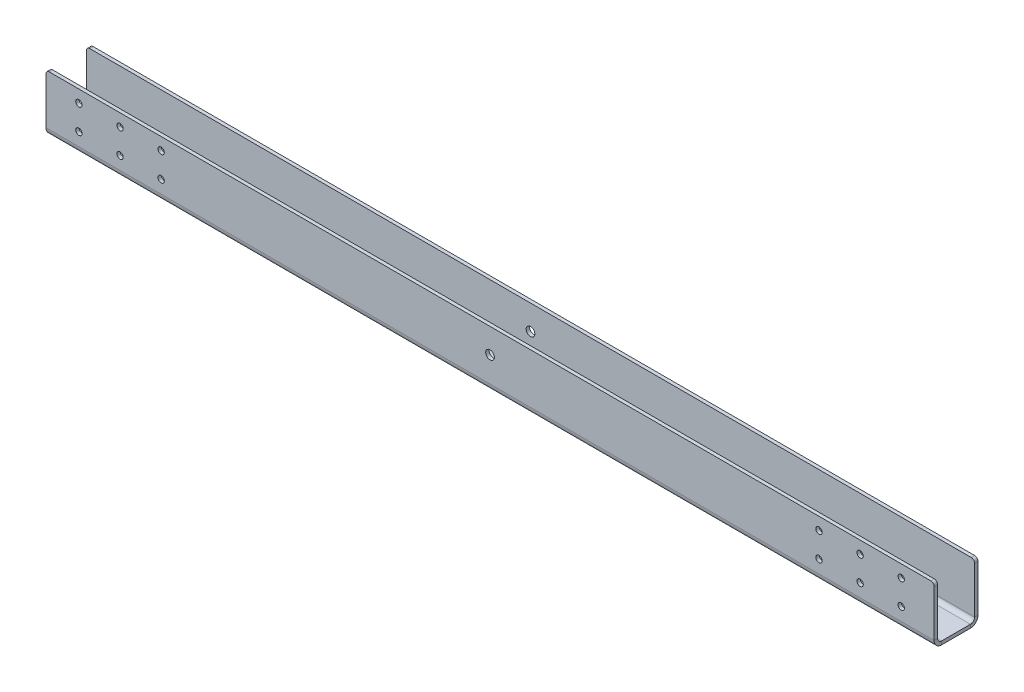
ISO-10303-21;
HEADER;
FILE_DESCRIPTION(('STEP AP214'),'2;1');
FILE_NAME('part.step','',(''),(''),'','','');
FILE_SCHEMA(('AUTOMOTIVE_DESIGN { 1 0 10303 214 1 1 1 1 }'));
ENDSEC;
DATA;
#1=APPLICATION_CONTEXT('core data for automotive mechanical design processes');
#2=APPLICATION_PROTOCOL_DEFINITION('international standard','automotive_design',2000,#1);
#3=PRODUCT_CONTEXT('',#1,'mechanical');
#4=PRODUCT('Part','Part','',(#3));
#5=PRODUCT_RELATED_PRODUCT_CATEGORY('part','',(#4));
#6=PRODUCT_DEFINITION_FORMATION('','',#4);
#7=PRODUCT_DEFINITION_CONTEXT('part definition',#1,'design');
#8=PRODUCT_DEFINITION('design','',#6,#7);
#9=PRODUCT_DEFINITION_SHAPE('','',#8);
#10=(LENGTH_UNIT() NAMED_UNIT(*) SI_UNIT(.MILLI.,.METRE.));
#11=(NAMED_UNIT(*) PLANE_ANGLE_UNIT() SI_UNIT($,.RADIAN.));
#12=(NAMED_UNIT(*) SI_UNIT($,.STERADIAN.) SOLID_ANGLE_UNIT());
#13=UNCERTAINTY_MEASURE_WITH_UNIT(LENGTH_MEASURE(1.E-05),#10,'distance_accuracy_value','');
#14=(GEOMETRIC_REPRESENTATION_CONTEXT(3) GLOBAL_UNCERTAINTY_ASSIGNED_CONTEXT((#13)) GLOBAL_UNIT_ASSIGNED_CONTEXT((#10,
#11,#12)) REPRESENTATION_CONTEXT('',''));
#15=CARTESIAN_POINT('',(0.,0.,0.));
#16=DIRECTION('',(0.,0.,1.));
#17=DIRECTION('',(1.,0.,0.));
#18=AXIS2_PLACEMENT_3D('',#15,#16,#17);
#19=CARTESIAN_POINT('',(0.,0.,5.83183999999999));
#20=DIRECTION('',(0.,0.,-1.));
#21=DIRECTION('',(-1.,0.,0.));
#22=AXIS2_PLACEMENT_3D('',#19,#20,#21);
#23=PLANE('',#22);
#24=CARTESIAN_POINT('',(596.899999999998,13.2181599999988,5.83183999999999));
#25=DIRECTION('',(0.,0.,1.));
#26=DIRECTION('',(1.,0.,0.));
#27=AXIS2_PLACEMENT_3D('',#24,#25,#26);
#28=CIRCLE('',#27,2.45744999999997);
#29=CARTESIAN_POINT('',(599.357449999998,13.2181599999988,5.83183999999999));
#30=VERTEX_POINT('',#29);
#31=EDGE_CURVE('E901',#30,#30,#28,.T.);
#32=ORIENTED_EDGE('',*,*,#31,.F.);
#33=EDGE_LOOP('',(#32));
#34=FACE_BOUND('',#33,.T.);
#35=CARTESIAN_POINT('',(596.899999999998,32.2681599999988,5.83183999999999));
#36=DIRECTION('',(0.,0.,1.));
#37=DIRECTION('',(1.,0.,0.));
#38=AXIS2_PLACEMENT_3D('',#35,#36,#37);
#39=CIRCLE('',#38,2.45744999999997);
#40=CARTESIAN_POINT('',(599.357449999998,32.2681599999988,5.83183999999999));
#41=VERTEX_POINT('',#40);
#42=EDGE_CURVE('E895',#41,#41,#39,.T.);
#43=ORIENTED_EDGE('',*,*,#42,.F.);
#44=EDGE_LOOP('',(#43));
#45=FACE_BOUND('',#44,.T.);
#46=CARTESIAN_POINT('',(660.399999999998,32.2681599999992,5.83183999999999));
#47=DIRECTION('',(0.,0.,1.));
#48=DIRECTION('',(1.,0.,0.));
#49=AXIS2_PLACEMENT_3D('',#46,#47,#48);
#50=CIRCLE('',#49,2.45744999999997);
#51=CARTESIAN_POINT('',(662.857449999998,32.2681599999992,5.83183999999999));
#52=VERTEX_POINT('',#51);
#53=EDGE_CURVE('E871',#52,#52,#50,.T.);
#54=ORIENTED_EDGE('',*,*,#53,.F.);
#55=EDGE_LOOP('',(#54));
#56=FACE_BOUND('',#55,.T.);
#57=CARTESIAN_POINT('',(88.8999999999975,32.2681599999952,5.83183999999999));
#58=DIRECTION('',(0.,0.,1.));
#59=DIRECTION('',(1.,0.,0.));
#60=AXIS2_PLACEMENT_3D('',#57,#58,#59);
#61=CIRCLE('',#60,2.45744999999999);
#62=CARTESIAN_POINT('',(91.3574499999975,32.2681599999952,5.83183999999999));
#63=VERTEX_POINT('',#62);
#64=EDGE_CURVE('E859',#63,#63,#61,.T.);
#65=ORIENTED_EDGE('',*,*,#64,.F.);
#66=EDGE_LOOP('',(#65));
#67=FACE_BOUND('',#66,.T.);
#68=CARTESIAN_POINT('',(57.1499999999976,13.218159999995,5.83183999999999));
#69=DIRECTION('',(0.,0.,1.));
#70=DIRECTION('',(1.,0.,0.));
#71=AXIS2_PLACEMENT_3D('',#68,#69,#70);
#72=CIRCLE('',#71,2.45744999999999);
#73=CARTESIAN_POINT('',(59.6074499999976,13.218159999995,5.83183999999999));
#74=VERTEX_POINT('',#73);
#75=EDGE_CURVE('E853',#74,#74,#72,.T.);
#76=ORIENTED_EDGE('',*,*,#75,.F.);
#77=EDGE_LOOP('',(#76));
#78=FACE_BOUND('',#77,.T.);
#79=CARTESIAN_POINT('',(25.3999999999975,32.2681599999948,5.83183999999999));
#80=DIRECTION('',(0.,0.,1.));
#81=DIRECTION('',(1.,0.,0.));
#82=AXIS2_PLACEMENT_3D('',#79,#80,#81);
#83=CIRCLE('',#82,2.45744999999999);
#84=CARTESIAN_POINT('',(27.8574499999975,32.2681599999948,5.83183999999999));
#85=VERTEX_POINT('',#84);
#86=EDGE_CURVE('E825',#85,#85,#83,.T.);
#87=ORIENTED_EDGE('',*,*,#86,.F.);
#88=EDGE_LOOP('',(#87));
#89=FACE_BOUND('',#88,.T.);
#90=CARTESIAN_POINT('',(342.9,22.7431600000001,5.83184000000011));
#91=DIRECTION('',(0.,0.,-1.));
#92=DIRECTION('',(0.,1.,0.));
#93=AXIS2_PLACEMENT_3D('',#90,#91,#92);
#94=CIRCLE('',#93,3.373501);
#95=CARTESIAN_POINT('',(342.9,26.1166610000001,5.8318400000001));
#96=VERTEX_POINT('',#95);
#97=EDGE_CURVE('E819',#96,#96,#94,.T.);
#98=ORIENTED_EDGE('',*,*,#97,.T.);
#99=EDGE_LOOP('',(#98));
#100=FACE_BOUND('',#99,.T.);
#101=DIRECTION('',(0.,1.,0.));
#102=VECTOR('',#101,1.);
#103=CARTESIAN_POINT('',(685.8,0.,5.83183999999999));
#104=LINE('',#103,#102);
#105=CARTESIAN_POINT('',(685.8,3.17499999999999,5.83183999999999));
#106=VERTEX_POINT('',#105);
#107=CARTESIAN_POINT('',(685.8,39.25316,5.83183999999999));
#108=VERTEX_POINT('',#107);
#109=EDGE_CURVE('E253',#106,#108,#104,.T.);
#110=ORIENTED_EDGE('',*,*,#109,.T.);
#111=CARTESIAN_POINT('',(683.26,39.25316,5.83183999999999));
#112=DIRECTION('',(0.,0.,-1.));
#113=DIRECTION('',(-1.,0.,0.));
#114=AXIS2_PLACEMENT_3D('',#111,#112,#113);
#115=CIRCLE('',#114,2.54);
#116=CARTESIAN_POINT('',(683.26,41.79316,5.83183999999999));
#117=VERTEX_POINT('',#116);
#118=EDGE_CURVE('E328',#108,#117,#115,.F.);
#119=ORIENTED_EDGE('',*,*,#118,.T.);
#120=DIRECTION('',(-1.,0.,0.));
#121=VECTOR('',#120,1.);
#122=CARTESIAN_POINT('',(0.,41.79316,5.83183999999999));
#123=LINE('',#122,#121);
#124=CARTESIAN_POINT('',(2.54,41.79316,5.83183999999999));
#125=VERTEX_POINT('',#124);
#126=EDGE_CURVE('E250',#117,#125,#123,.T.);
#127=ORIENTED_EDGE('',*,*,#126,.T.);
#128=CARTESIAN_POINT('',(2.54,39.25316,5.83183999999999));
#129=DIRECTION('',(0.,0.,-1.));
#130=DIRECTION('',(-1.,0.,0.));
#131=AXIS2_PLACEMENT_3D('',#128,#129,#130);
#132=CIRCLE('',#131,2.54);
#133=CARTESIAN_POINT('',(0.,39.25316,5.83183999999999));
#134=VERTEX_POINT('',#133);
#135=EDGE_CURVE('E326',#125,#134,#132,.F.);
#136=ORIENTED_EDGE('',*,*,#135,.T.);
#137=DIRECTION('',(0.,-1.,0.));
#138=VECTOR('',#137,1.);
#139=CARTESIAN_POINT('',(0.,0.,5.83183999999999));
#140=LINE('',#139,#138);
#141=CARTESIAN_POINT('',(0.,3.17499999999999,5.83183999999999));
#142=VERTEX_POINT('',#141);
#143=EDGE_CURVE('E247',#134,#142,#140,.T.);
#144=ORIENTED_EDGE('',*,*,#143,.T.);
#145=DIRECTION('',(1.,0.,0.));
#146=VECTOR('',#145,1.);
#147=CARTESIAN_POINT('',(0.,3.17499999999999,5.83183999999999));
#148=LINE('',#147,#146);
#149=EDGE_CURVE('E264',#106,#142,#148,.F.);
#150=ORIENTED_EDGE('',*,*,#149,.F.);
#151=EDGE_LOOP('',(#110,#119,#127,#136,#144,#150));
#152=FACE_BOUND('',#151,.T.);
#153=CARTESIAN_POINT('',(25.3999999999976,13.2181599999948,5.83183999999999));
#154=DIRECTION('',(0.,0.,1.));
#155=DIRECTION('',(1.,0.,0.));
#156=AXIS2_PLACEMENT_3D('',#153,#154,#155);
#157=CIRCLE('',#156,2.45744999999999);
#158=CARTESIAN_POINT('',(27.8574499999976,13.2181599999948,5.83183999999999));
#159=VERTEX_POINT('',#158);
#160=EDGE_CURVE('E841',#159,#159,#157,.T.);
#161=ORIENTED_EDGE('',*,*,#160,.F.);
#162=EDGE_LOOP('',(#161));
#163=FACE_BOUND('',#162,.T.);
#164=CARTESIAN_POINT('',(57.1499999999975,32.268159999995,5.83183999999999));
#165=DIRECTION('',(0.,0.,1.));
#166=DIRECTION('',(1.,0.,0.));
#167=AXIS2_PLACEMENT_3D('',#164,#165,#166);
#168=CIRCLE('',#167,2.45744999999999);
#169=CARTESIAN_POINT('',(59.6074499999975,32.268159999995,5.83183999999999));
#170=VERTEX_POINT('',#169);
#171=EDGE_CURVE('E847',#170,#170,#168,.T.);
#172=ORIENTED_EDGE('',*,*,#171,.F.);
#173=EDGE_LOOP('',(#172));
#174=FACE_BOUND('',#173,.T.);
#175=CARTESIAN_POINT('',(88.8999999999976,13.2181599999952,5.83183999999999));
#176=DIRECTION('',(0.,0.,1.));
#177=DIRECTION('',(1.,0.,0.));
#178=AXIS2_PLACEMENT_3D('',#175,#176,#177);
#179=CIRCLE('',#178,2.45744999999999);
#180=CARTESIAN_POINT('',(91.3574499999976,13.2181599999952,5.83183999999999));
#181=VERTEX_POINT('',#180);
#182=EDGE_CURVE('E865',#181,#181,#179,.T.);
#183=ORIENTED_EDGE('',*,*,#182,.F.);
#184=EDGE_LOOP('',(#183));
#185=FACE_BOUND('',#184,.T.);
#186=CARTESIAN_POINT('',(660.399999999998,13.2181599999992,5.83183999999999));
#187=DIRECTION('',(0.,0.,1.));
#188=DIRECTION('',(1.,0.,0.));
#189=AXIS2_PLACEMENT_3D('',#186,#187,#188);
#190=CIRCLE('',#189,2.45744999999997);
#191=CARTESIAN_POINT('',(662.857449999998,13.2181599999992,5.83183999999999));
#192=VERTEX_POINT('',#191);
#193=EDGE_CURVE('E877',#192,#192,#190,.T.);
#194=ORIENTED_EDGE('',*,*,#193,.F.);
#195=EDGE_LOOP('',(#194));
#196=FACE_BOUND('',#195,.T.);
#197=CARTESIAN_POINT('',(628.649999999998,13.218159999999,5.83183999999999));
#198=DIRECTION('',(0.,0.,1.));
#199=DIRECTION('',(1.,0.,0.));
#200=AXIS2_PLACEMENT_3D('',#197,#198,#199);
#201=CIRCLE('',#200,2.45744999999997);
#202=CARTESIAN_POINT('',(631.107449999998,13.218159999999,5.83183999999999));
#203=VERTEX_POINT('',#202);
#204=EDGE_CURVE('E883',#203,#203,#201,.T.);
#205=ORIENTED_EDGE('',*,*,#204,.F.);
#206=EDGE_LOOP('',(#205));
#207=FACE_BOUND('',#206,.T.);
#208=CARTESIAN_POINT('',(628.649999999998,32.268159999999,5.83183999999999));
#209=DIRECTION('',(0.,0.,1.));
#210=DIRECTION('',(1.,0.,0.));
#211=AXIS2_PLACEMENT_3D('',#208,#209,#210);
#212=CIRCLE('',#211,2.45744999999997);
#213=CARTESIAN_POINT('',(631.107449999998,32.268159999999,5.83183999999999));
#214=VERTEX_POINT('',#213);
#215=EDGE_CURVE('E889',#214,#214,#212,.T.);
#216=ORIENTED_EDGE('',*,*,#215,.F.);
#217=EDGE_LOOP('',(#216));
#218=FACE_BOUND('',#217,.T.);
#219=ADVANCED_FACE('F78',(#34,#45,#56,#67,#78,#89,#100,#152,#163,#174,#185,#196,#207,#218),#23,.F.);
#220=CARTESIAN_POINT('',(0.,-2.65684,0.));
#221=DIRECTION('',(-1.,0.,0.));
#222=DIRECTION('',(0.,0.,1.));
#223=AXIS2_PLACEMENT_3D('',#220,#221,#222);
#224=PLANE('',#223);
#225=DIRECTION('',(0.,0.,1.));
#226=VECTOR('',#225,1.);
#227=CARTESIAN_POINT('',(0.,0.,0.));
#228=LINE('',#227,#226);
#229=CARTESIAN_POINT('',(0.,0.,-22.225));
#230=VERTEX_POINT('',#229);
#231=CARTESIAN_POINT('',(0.,0.,0.));
#232=VERTEX_POINT('',#231);
#233=EDGE_CURVE('E277',#230,#232,#228,.T.);
#234=ORIENTED_EDGE('',*,*,#233,.F.);
#235=DIRECTION('',(0.,1.,0.));
#236=VECTOR('',#235,1.);
#237=CARTESIAN_POINT('',(0.,-2.65684,-22.225));
#238=LINE('',#237,#236);
#239=CARTESIAN_POINT('',(0.,-2.65684000000002,-22.225));
#240=VERTEX_POINT('',#239);
#241=EDGE_CURVE('E307',#240,#230,#238,.T.);
#242=ORIENTED_EDGE('',*,*,#241,.F.);
#243=DIRECTION('',(0.,0.,1.));
#244=VECTOR('',#243,1.);
#245=CARTESIAN_POINT('',(0.,-2.65684,0.));
#246=LINE('',#245,#244);
#247=CARTESIAN_POINT('',(0.,-2.65684,0.));
#248=VERTEX_POINT('',#247);
#249=EDGE_CURVE('E286',#240,#248,#246,.T.);
#250=ORIENTED_EDGE('',*,*,#249,.T.);
#251=DIRECTION('',(0.,1.,0.));
#252=VECTOR('',#251,1.);
#253=CARTESIAN_POINT('',(0.,-2.65684,0.));
#254=LINE('',#253,#252);
#255=EDGE_CURVE('E296',#248,#232,#254,.T.);
#256=ORIENTED_EDGE('',*,*,#255,.T.);
#257=EDGE_LOOP('',(#234,#242,#250,#256));
#258=FACE_BOUND('',#257,.T.);
#259=ADVANCED_FACE('F418',(#258),#224,.T.);
#260=CARTESIAN_POINT('',(685.8,-2.65684,0.));
#261=DIRECTION('',(1.,0.,0.));
#262=DIRECTION('',(0.,0.,-1.));
#263=AXIS2_PLACEMENT_3D('',#260,#261,#262);
#264=PLANE('',#263);
#265=DIRECTION('',(0.,0.,-1.));
#266=VECTOR('',#265,1.);
#267=CARTESIAN_POINT('',(685.8,0.,0.));
#268=LINE('',#267,#266);
#269=CARTESIAN_POINT('',(685.8,0.,0.));
#270=VERTEX_POINT('',#269);
#271=CARTESIAN_POINT('',(685.8,0.,-22.225));
#272=VERTEX_POINT('',#271);
#273=EDGE_CURVE('E302',#270,#272,#268,.T.);
#274=ORIENTED_EDGE('',*,*,#273,.F.);
#275=DIRECTION('',(0.,1.,0.));
#276=VECTOR('',#275,1.);
#277=CARTESIAN_POINT('',(685.8,-2.65684,0.));
#278=LINE('',#277,#276);
#279=CARTESIAN_POINT('',(685.8,-2.65684000000003,0.));
#280=VERTEX_POINT('',#279);
#281=EDGE_CURVE('E312',#280,#270,#278,.T.);
#282=ORIENTED_EDGE('',*,*,#281,.F.);
#283=DIRECTION('',(0.,0.,-1.));
#284=VECTOR('',#283,1.);
#285=CARTESIAN_POINT('',(685.8,-2.65684,0.));
#286=LINE('',#285,#284);
#287=CARTESIAN_POINT('',(685.8,-2.65684,-22.225));
#288=VERTEX_POINT('',#287);
#289=EDGE_CURVE('E293',#280,#288,#286,.T.);
#290=ORIENTED_EDGE('',*,*,#289,.T.);
#291=DIRECTION('',(0.,1.,0.));
#292=VECTOR('',#291,1.);
#293=CARTESIAN_POINT('',(685.8,-2.65684,-22.225));
#294=LINE('',#293,#292);
#295=EDGE_CURVE('E310',#288,#272,#294,.T.);
#296=ORIENTED_EDGE('',*,*,#295,.T.);
#297=EDGE_LOOP('',(#274,#282,#290,#296));
#298=FACE_BOUND('',#297,.T.);
#299=ADVANCED_FACE('F368',(#298),#264,.T.);
#300=CARTESIAN_POINT('',(0.,-2.65684,0.));
#301=DIRECTION('',(0.,-1.,0.));
#302=DIRECTION('',(0.,0.,-1.));
#303=AXIS2_PLACEMENT_3D('',#300,#301,#302);
#304=PLANE('',#303);
#305=ORIENTED_EDGE('',*,*,#249,.F.);
#306=DIRECTION('',(-1.,0.,0.));
#307=VECTOR('',#306,1.);
#308=CARTESIAN_POINT('',(0.,-2.65684,-22.225));
#309=LINE('',#308,#307);
#310=EDGE_CURVE('E203',#288,#240,#309,.T.);
#311=ORIENTED_EDGE('',*,*,#310,.F.);
#312=ORIENTED_EDGE('',*,*,#289,.F.);
#313=DIRECTION('',(1.,0.,0.));
#314=VECTOR('',#313,1.);
#315=CARTESIAN_POINT('',(0.,-2.65684,0.));
#316=LINE('',#315,#314);
#317=EDGE_CURVE('E289',#248,#280,#316,.T.);
#318=ORIENTED_EDGE('',*,*,#317,.F.);
#319=EDGE_LOOP('',(#305,#311,#312,#318));
#320=FACE_BOUND('',#319,.T.);
#321=ADVANCED_FACE('F415',(#320),#304,.T.);
#322=CARTESIAN_POINT('',(0.,0.,0.));
#323=DIRECTION('',(0.,-1.,0.));
#324=DIRECTION('',(0.,0.,-1.));
#325=AXIS2_PLACEMENT_3D('',#322,#323,#324);
#326=PLANE('',#325);
#327=ORIENTED_EDGE('',*,*,#233,.T.);
#328=DIRECTION('',(1.,0.,0.));
#329=VECTOR('',#328,1.);
#330=CARTESIAN_POINT('',(0.,0.,0.));
#331=LINE('',#330,#329);
#332=EDGE_CURVE('E299',#232,#270,#331,.T.);
#333=ORIENTED_EDGE('',*,*,#332,.T.);
#334=ORIENTED_EDGE('',*,*,#273,.T.);
#335=DIRECTION('',(-1.,0.,0.));
#336=VECTOR('',#335,1.);
#337=CARTESIAN_POINT('',(0.,0.,-22.225));
#338=LINE('',#337,#336);
#339=EDGE_CURVE('E290',#272,#230,#338,.T.);
#340=ORIENTED_EDGE('',*,*,#339,.T.);
#341=EDGE_LOOP('',(#327,#333,#334,#340));
#342=FACE_BOUND('',#341,.T.);
#343=ADVANCED_FACE('F371',(#342),#326,.F.);
#344=CARTESIAN_POINT('',(0.,3.17499999999999,0.));
#345=DIRECTION('',(-1.,0.,0.));
#346=DIRECTION('',(0.,0.,1.));
#347=AXIS2_PLACEMENT_3D('',#344,#345,#346);
#348=PLANE('',#347);
#349=DIRECTION('',(0.,0.,-1.));
#350=VECTOR('',#349,1.);
#351=CARTESIAN_POINT('',(0.,3.17499999999999,5.83183999999999));
#352=LINE('',#351,#350);
#353=CARTESIAN_POINT('',(0.,3.17499999999999,3.17499999999999));
#354=VERTEX_POINT('',#353);
#355=EDGE_CURVE('E242',#354,#142,#352,.F.);
#356=ORIENTED_EDGE('',*,*,#355,.F.);
#357=CARTESIAN_POINT('',(0.,3.17499999999999,0.));
#358=DIRECTION('',(1.,0.,0.));
#359=DIRECTION('',(0.,0.,-1.));
#360=AXIS2_PLACEMENT_3D('',#357,#358,#359);
#361=CIRCLE('',#360,3.17500000000002);
#362=EDGE_CURVE('E281',#232,#354,#361,.F.);
#363=ORIENTED_EDGE('',*,*,#362,.F.);
#364=ORIENTED_EDGE('',*,*,#255,.F.);
#365=CARTESIAN_POINT('',(0.,3.17499999999999,0.));
#366=DIRECTION('',(1.,0.,0.));
#367=DIRECTION('',(0.,0.,-1.));
#368=AXIS2_PLACEMENT_3D('',#365,#366,#367);
#369=CIRCLE('',#368,5.83184000000002);
#370=EDGE_CURVE('E274',#248,#142,#369,.F.);
#371=ORIENTED_EDGE('',*,*,#370,.T.);
#372=EDGE_LOOP('',(#356,#363,#364,#371));
#373=FACE_BOUND('',#372,.T.);
#374=ADVANCED_FACE('F409',(#373),#348,.T.);
#375=CARTESIAN_POINT('',(685.8,3.17499999999999,0.));
#376=DIRECTION('',(-1.,0.,0.));
#377=DIRECTION('',(0.,0.,1.));
#378=AXIS2_PLACEMENT_3D('',#375,#376,#377);
#379=PLANE('',#378);
#380=CARTESIAN_POINT('',(685.8,3.17499999999999,0.));
#381=DIRECTION('',(1.,0.,0.));
#382=DIRECTION('',(0.,0.,-1.));
#383=AXIS2_PLACEMENT_3D('',#380,#381,#382);
#384=CIRCLE('',#383,3.17500000000002);
#385=CARTESIAN_POINT('',(685.8,3.17499999999999,3.17500000000004));
#386=VERTEX_POINT('',#385);
#387=EDGE_CURVE('E249',#386,#270,#384,.T.);
#388=ORIENTED_EDGE('',*,*,#387,.F.);
#389=DIRECTION('',(0.,0.,-1.));
#390=VECTOR('',#389,1.);
#391=CARTESIAN_POINT('',(685.8,3.17499999999999,3.175));
#392=LINE('',#391,#390);
#393=EDGE_CURVE('E267',#386,#106,#392,.F.);
#394=ORIENTED_EDGE('',*,*,#393,.T.);
#395=CARTESIAN_POINT('',(685.8,3.17499999999999,0.));
#396=DIRECTION('',(1.,0.,0.));
#397=DIRECTION('',(0.,0.,-1.));
#398=AXIS2_PLACEMENT_3D('',#395,#396,#397);
#399=CIRCLE('',#398,5.83184000000002);
#400=EDGE_CURVE('E278',#106,#280,#399,.T.);
#401=ORIENTED_EDGE('',*,*,#400,.T.);
#402=ORIENTED_EDGE('',*,*,#281,.T.);
#403=EDGE_LOOP('',(#388,#394,#401,#402));
#404=FACE_BOUND('',#403,.T.);
#405=ADVANCED_FACE('F377',(#404),#379,.F.);
#406=CARTESIAN_POINT('',(685.8,3.17499999999999,0.));
#407=DIRECTION('',(1.,0.,0.));
#408=DIRECTION('',(0.,0.,1.));
#409=AXIS2_PLACEMENT_3D('',#406,#407,#408);
#410=CYLINDRICAL_SURFACE('',#409,5.83184000000002);
#411=ORIENTED_EDGE('',*,*,#317,.T.);
#412=ORIENTED_EDGE('',*,*,#400,.F.);
#413=ORIENTED_EDGE('',*,*,#149,.T.);
#414=ORIENTED_EDGE('',*,*,#370,.F.);
#415=EDGE_LOOP('',(#411,#412,#413,#414));
#416=FACE_BOUND('',#415,.T.);
#417=ADVANCED_FACE('F413',(#416),#410,.T.);
#418=CARTESIAN_POINT('',(685.8,3.17499999999999,0.));
#419=DIRECTION('',(1.,0.,0.));
#420=DIRECTION('',(0.,0.,1.));
#421=AXIS2_PLACEMENT_3D('',#418,#419,#420);
#422=CYLINDRICAL_SURFACE('',#421,3.17500000000002);
#423=ORIENTED_EDGE('',*,*,#332,.F.);
#424=ORIENTED_EDGE('',*,*,#362,.T.);
#425=DIRECTION('',(1.,0.,0.));
#426=VECTOR('',#425,1.);
#427=CARTESIAN_POINT('',(0.,3.17499999999999,3.175));
#428=LINE('',#427,#426);
#429=EDGE_CURVE('E270',#354,#386,#428,.T.);
#430=ORIENTED_EDGE('',*,*,#429,.T.);
#431=ORIENTED_EDGE('',*,*,#387,.T.);
#432=EDGE_LOOP('',(#423,#424,#430,#431));
#433=FACE_BOUND('',#432,.T.);
#434=ADVANCED_FACE('F379',(#433),#422,.F.);
#435=CARTESIAN_POINT('',(685.8,41.79316,5.83183999999999));
#436=DIRECTION('',(-1.,0.,0.));
#437=DIRECTION('',(0.,0.,1.));
#438=AXIS2_PLACEMENT_3D('',#435,#436,#437);
#439=PLANE('',#438);
#440=DIRECTION('',(0.,-1.,0.));
#441=VECTOR('',#440,1.);
#442=CARTESIAN_POINT('',(685.8,41.79316,3.17499999999999));
#443=LINE('',#442,#441);
#444=CARTESIAN_POINT('',(685.8,39.25316,3.17499999999999));
#445=VERTEX_POINT('',#444);
#446=EDGE_CURVE('E261',#386,#445,#443,.F.);
#447=ORIENTED_EDGE('',*,*,#446,.T.);
#448=DIRECTION('',(0.,0.,-1.));
#449=VECTOR('',#448,1.);
#450=CARTESIAN_POINT('',(685.8,39.25316,5.83183999999999));
#451=LINE('',#450,#449);
#452=EDGE_CURVE('E324',#445,#108,#451,.F.);
#453=ORIENTED_EDGE('',*,*,#452,.T.);
#454=ORIENTED_EDGE('',*,*,#109,.F.);
#455=ORIENTED_EDGE('',*,*,#393,.F.);
#456=EDGE_LOOP('',(#447,#453,#454,#455));
#457=FACE_BOUND('',#456,.T.);
#458=ADVANCED_FACE('F388',(#457),#439,.F.);
#459=CARTESIAN_POINT('',(0.,0.,5.83183999999999));
#460=DIRECTION('',(1.,0.,0.));
#461=DIRECTION('',(0.,0.,-1.));
#462=AXIS2_PLACEMENT_3D('',#459,#460,#461);
#463=PLANE('',#462);
#464=ORIENTED_EDGE('',*,*,#143,.F.);
#465=DIRECTION('',(0.,0.,-1.));
#466=VECTOR('',#465,1.);
#467=CARTESIAN_POINT('',(0.,39.25316,5.83183999999999));
#468=LINE('',#467,#466);
#469=CARTESIAN_POINT('',(0.,39.25316,3.17499999999999));
#470=VERTEX_POINT('',#469);
#471=EDGE_CURVE('E13',#134,#470,#468,.T.);
#472=ORIENTED_EDGE('',*,*,#471,.T.);
#473=DIRECTION('',(0.,1.,0.));
#474=VECTOR('',#473,1.);
#475=CARTESIAN_POINT('',(0.,0.,3.17499999999999));
#476=LINE('',#475,#474);
#477=EDGE_CURVE('E256',#470,#354,#476,.F.);
#478=ORIENTED_EDGE('',*,*,#477,.T.);
#479=ORIENTED_EDGE('',*,*,#355,.T.);
#480=EDGE_LOOP('',(#464,#472,#478,#479));
#481=FACE_BOUND('',#480,.T.);
#482=ADVANCED_FACE('F406',(#481),#463,.F.);
#483=CARTESIAN_POINT('',(0.,0.,3.17499999999999));
#484=DIRECTION('',(0.,0.,-1.));
#485=DIRECTION('',(-1.,0.,0.));
#486=AXIS2_PLACEMENT_3D('',#483,#484,#485);
#487=PLANE('',#486);
#488=CARTESIAN_POINT('',(596.899999999998,13.2181599999988,3.17499999999999));
#489=DIRECTION('',(0.,0.,-1.));
#490=DIRECTION('',(-1.,0.,0.));
#491=AXIS2_PLACEMENT_3D('',#488,#489,#490);
#492=CIRCLE('',#491,2.45744999999997);
#493=CARTESIAN_POINT('',(594.442549999998,13.2181599999988,3.17499999999999));
#494=VERTEX_POINT('',#493);
#495=EDGE_CURVE('E898',#494,#494,#492,.T.);
#496=ORIENTED_EDGE('',*,*,#495,.F.);
#497=EDGE_LOOP('',(#496));
#498=FACE_BOUND('',#497,.T.);
#499=CARTESIAN_POINT('',(596.899999999998,32.2681599999988,3.17499999999999));
#500=DIRECTION('',(0.,0.,-1.));
#501=DIRECTION('',(-1.,0.,0.));
#502=AXIS2_PLACEMENT_3D('',#499,#500,#501);
#503=CIRCLE('',#502,2.45744999999997);
#504=CARTESIAN_POINT('',(594.442549999998,32.2681599999988,3.17499999999999));
#505=VERTEX_POINT('',#504);
#506=EDGE_CURVE('E892',#505,#505,#503,.T.);
#507=ORIENTED_EDGE('',*,*,#506,.F.);
#508=EDGE_LOOP('',(#507));
#509=FACE_BOUND('',#508,.T.);
#510=CARTESIAN_POINT('',(628.649999999998,32.268159999999,3.17499999999999));
#511=DIRECTION('',(0.,0.,-1.));
#512=DIRECTION('',(-1.,0.,0.));
#513=AXIS2_PLACEMENT_3D('',#510,#511,#512);
#514=CIRCLE('',#513,2.45744999999997);
#515=CARTESIAN_POINT('',(626.192549999998,32.268159999999,3.17499999999999));
#516=VERTEX_POINT('',#515);
#517=EDGE_CURVE('E886',#516,#516,#514,.T.);
#518=ORIENTED_EDGE('',*,*,#517,.F.);
#519=EDGE_LOOP('',(#518));
#520=FACE_BOUND('',#519,.T.);
#521=CARTESIAN_POINT('',(628.649999999998,13.218159999999,3.17499999999999));
#522=DIRECTION('',(0.,0.,-1.));
#523=DIRECTION('',(-1.,0.,0.));
#524=AXIS2_PLACEMENT_3D('',#521,#522,#523);
#525=CIRCLE('',#524,2.45744999999997);
#526=CARTESIAN_POINT('',(626.192549999998,13.218159999999,3.17499999999999));
#527=VERTEX_POINT('',#526);
#528=EDGE_CURVE('E880',#527,#527,#525,.T.);
#529=ORIENTED_EDGE('',*,*,#528,.F.);
#530=EDGE_LOOP('',(#529));
#531=FACE_BOUND('',#530,.T.);
#532=CARTESIAN_POINT('',(660.399999999998,13.2181599999992,3.17499999999999));
#533=DIRECTION('',(0.,0.,-1.));
#534=DIRECTION('',(-1.,0.,0.));
#535=AXIS2_PLACEMENT_3D('',#532,#533,#534);
#536=CIRCLE('',#535,2.45744999999997);
#537=CARTESIAN_POINT('',(657.942549999998,13.2181599999992,3.17499999999999));
#538=VERTEX_POINT('',#537);
#539=EDGE_CURVE('E874',#538,#538,#536,.T.);
#540=ORIENTED_EDGE('',*,*,#539,.F.);
#541=EDGE_LOOP('',(#540));
#542=FACE_BOUND('',#541,.T.);
#543=CARTESIAN_POINT('',(660.399999999998,32.2681599999992,3.17499999999999));
#544=DIRECTION('',(0.,0.,-1.));
#545=DIRECTION('',(-1.,0.,0.));
#546=AXIS2_PLACEMENT_3D('',#543,#544,#545);
#547=CIRCLE('',#546,2.45744999999997);
#548=CARTESIAN_POINT('',(657.942549999998,32.2681599999992,3.17499999999999));
#549=VERTEX_POINT('',#548);
#550=EDGE_CURVE('E868',#549,#549,#547,.T.);
#551=ORIENTED_EDGE('',*,*,#550,.F.);
#552=EDGE_LOOP('',(#551));
#553=FACE_BOUND('',#552,.T.);
#554=CARTESIAN_POINT('',(88.8999999999976,13.2181599999952,3.17499999999999));
#555=DIRECTION('',(0.,0.,-1.));
#556=DIRECTION('',(-1.,0.,0.));
#557=AXIS2_PLACEMENT_3D('',#554,#555,#556);
#558=CIRCLE('',#557,2.45744999999999);
#559=CARTESIAN_POINT('',(86.4425499999977,13.2181599999952,3.17499999999999));
#560=VERTEX_POINT('',#559);
#561=EDGE_CURVE('E862',#560,#560,#558,.T.);
#562=ORIENTED_EDGE('',*,*,#561,.F.);
#563=EDGE_LOOP('',(#562));
#564=FACE_BOUND('',#563,.T.);
#565=CARTESIAN_POINT('',(88.8999999999975,32.2681599999952,3.17499999999999));
#566=DIRECTION('',(0.,0.,-1.));
#567=DIRECTION('',(-1.,0.,0.));
#568=AXIS2_PLACEMENT_3D('',#565,#566,#567);
#569=CIRCLE('',#568,2.45744999999999);
#570=CARTESIAN_POINT('',(86.4425499999975,32.2681599999952,3.17499999999999));
#571=VERTEX_POINT('',#570);
#572=EDGE_CURVE('E856',#571,#571,#569,.T.);
#573=ORIENTED_EDGE('',*,*,#572,.F.);
#574=EDGE_LOOP('',(#573));
#575=FACE_BOUND('',#574,.T.);
#576=CARTESIAN_POINT('',(57.1499999999976,13.218159999995,3.17499999999999));
#577=DIRECTION('',(0.,0.,-1.));
#578=DIRECTION('',(-1.,0.,0.));
#579=AXIS2_PLACEMENT_3D('',#576,#577,#578);
#580=CIRCLE('',#579,2.45744999999999);
#581=CARTESIAN_POINT('',(54.6925499999976,13.218159999995,3.17499999999999));
#582=VERTEX_POINT('',#581);
#583=EDGE_CURVE('E850',#582,#582,#580,.T.);
#584=ORIENTED_EDGE('',*,*,#583,.F.);
#585=EDGE_LOOP('',(#584));
#586=FACE_BOUND('',#585,.T.);
#587=CARTESIAN_POINT('',(57.1499999999975,32.268159999995,3.17499999999999));
#588=DIRECTION('',(0.,0.,-1.));
#589=DIRECTION('',(-1.,0.,0.));
#590=AXIS2_PLACEMENT_3D('',#587,#588,#589);
#591=CIRCLE('',#590,2.45744999999999);
#592=CARTESIAN_POINT('',(54.6925499999975,32.268159999995,3.17499999999999));
#593=VERTEX_POINT('',#592);
#594=EDGE_CURVE('E844',#593,#593,#591,.T.);
#595=ORIENTED_EDGE('',*,*,#594,.F.);
#596=EDGE_LOOP('',(#595));
#597=FACE_BOUND('',#596,.T.);
#598=CARTESIAN_POINT('',(25.3999999999976,13.2181599999948,3.17499999999999));
#599=DIRECTION('',(0.,0.,-1.));
#600=DIRECTION('',(-1.,0.,0.));
#601=AXIS2_PLACEMENT_3D('',#598,#599,#600);
#602=CIRCLE('',#601,2.45744999999999);
#603=CARTESIAN_POINT('',(22.9425499999976,13.2181599999948,3.17499999999999));
#604=VERTEX_POINT('',#603);
#605=EDGE_CURVE('E838',#604,#604,#602,.T.);
#606=ORIENTED_EDGE('',*,*,#605,.F.);
#607=EDGE_LOOP('',(#606));
#608=FACE_BOUND('',#607,.T.);
#609=CARTESIAN_POINT('',(25.3999999999975,32.2681599999948,3.17499999999999));
#610=DIRECTION('',(0.,0.,-1.));
#611=DIRECTION('',(-1.,0.,0.));
#612=AXIS2_PLACEMENT_3D('',#609,#610,#611);
#613=CIRCLE('',#612,2.45744999999999);
#614=CARTESIAN_POINT('',(22.9425499999975,32.2681599999948,3.17499999999999));
#615=VERTEX_POINT('',#614);
#616=EDGE_CURVE('E820',#615,#615,#613,.T.);
#617=ORIENTED_EDGE('',*,*,#616,.F.);
#618=EDGE_LOOP('',(#617));
#619=FACE_BOUND('',#618,.T.);
#620=CARTESIAN_POINT('',(342.9,22.7431600000001,3.17499999999999));
#621=DIRECTION('',(0.,0.,-1.));
#622=DIRECTION('',(-1.,0.,0.));
#623=AXIS2_PLACEMENT_3D('',#620,#621,#622);
#624=CIRCLE('',#623,3.373501);
#625=CARTESIAN_POINT('',(339.526499,22.7431600000001,3.17499999999999));
#626=VERTEX_POINT('',#625);
#627=EDGE_CURVE('E241',#626,#626,#624,.T.);
#628=ORIENTED_EDGE('',*,*,#627,.F.);
#629=EDGE_LOOP('',(#628));
#630=FACE_BOUND('',#629,.T.);
#631=DIRECTION('',(1.,0.,0.));
#632=VECTOR('',#631,1.);
#633=CARTESIAN_POINT('',(0.,41.79316,3.17499999999999));
#634=LINE('',#633,#632);
#635=CARTESIAN_POINT('',(683.26,41.79316,3.17499999999999));
#636=VERTEX_POINT('',#635);
#637=CARTESIAN_POINT('',(2.54,41.79316,3.17499999999999));
#638=VERTEX_POINT('',#637);
#639=EDGE_CURVE('E258',#636,#638,#634,.F.);
#640=ORIENTED_EDGE('',*,*,#639,.F.);
#641=CARTESIAN_POINT('',(683.26,39.25316,3.17499999999999));
#642=DIRECTION('',(0.,0.,-1.));
#643=DIRECTION('',(-1.,0.,0.));
#644=AXIS2_PLACEMENT_3D('',#641,#642,#643);
#645=CIRCLE('',#644,2.54);
#646=EDGE_CURVE('E322',#636,#445,#645,.T.);
#647=ORIENTED_EDGE('',*,*,#646,.T.);
#648=ORIENTED_EDGE('',*,*,#446,.F.);
#649=ORIENTED_EDGE('',*,*,#429,.F.);
#650=ORIENTED_EDGE('',*,*,#477,.F.);
#651=CARTESIAN_POINT('',(2.54,39.25316,3.17499999999999));
#652=DIRECTION('',(0.,0.,-1.));
#653=DIRECTION('',(-1.,0.,0.));
#654=AXIS2_PLACEMENT_3D('',#651,#652,#653);
#655=CIRCLE('',#654,2.54);
#656=EDGE_CURVE('E320',#470,#638,#655,.T.);
#657=ORIENTED_EDGE('',*,*,#656,.T.);
#658=EDGE_LOOP('',(#640,#647,#648,#649,#650,#657));
#659=FACE_BOUND('',#658,.T.);
#660=ADVANCED_FACE('F385',(#498,#509,#520,#531,#542,#553,#564,#575,#586,#597,#608,#619,#630,
#659),#487,.T.);
#661=CARTESIAN_POINT('',(0.,41.79316,5.83183999999999));
#662=DIRECTION('',(0.,-1.,0.));
#663=DIRECTION('',(0.,0.,-1.));
#664=AXIS2_PLACEMENT_3D('',#661,#662,#663);
#665=PLANE('',#664);
#666=ORIENTED_EDGE('',*,*,#126,.F.);
#667=DIRECTION('',(0.,0.,-1.));
#668=VECTOR('',#667,1.);
#669=CARTESIAN_POINT('',(683.26,41.79316,5.83183999999999));
#670=LINE('',#669,#668);
#671=EDGE_CURVE('E317',#117,#636,#670,.T.);
#672=ORIENTED_EDGE('',*,*,#671,.T.);
#673=ORIENTED_EDGE('',*,*,#639,.T.);
#674=DIRECTION('',(0.,0.,-1.));
#675=VECTOR('',#674,1.);
#676=CARTESIAN_POINT('',(2.54,41.79316,5.83183999999999));
#677=LINE('',#676,#675);
#678=EDGE_CURVE('E309',#638,#125,#677,.F.);
#679=ORIENTED_EDGE('',*,*,#678,.T.);
#680=EDGE_LOOP('',(#666,#672,#673,#679));
#681=FACE_BOUND('',#680,.T.);
#682=ADVANCED_FACE('F400',(#681),#665,.F.);
#683=CARTESIAN_POINT('',(685.8,3.17499999999998,-22.225));
#684=DIRECTION('',(1.,0.,0.));
#685=DIRECTION('',(0.,0.,-1.));
#686=AXIS2_PLACEMENT_3D('',#683,#684,#685);
#687=PLANE('',#686);
#688=DIRECTION('',(0.,0.,1.));
#689=VECTOR('',#688,1.);
#690=CARTESIAN_POINT('',(685.8,3.17500000000001,-28.05684));
#691=LINE('',#690,#689);
#692=CARTESIAN_POINT('',(685.8,3.17499999999997,-25.4));
#693=VERTEX_POINT('',#692);
#694=CARTESIAN_POINT('',(685.8,3.17499999999996,-28.05684));
#695=VERTEX_POINT('',#694);
#696=EDGE_CURVE('E238',#693,#695,#691,.F.);
#697=ORIENTED_EDGE('',*,*,#696,.F.);
#698=CARTESIAN_POINT('',(685.8,3.17499999999998,-22.225));
#699=DIRECTION('',(-1.,0.,0.));
#700=DIRECTION('',(0.,0.,1.));
#701=AXIS2_PLACEMENT_3D('',#698,#699,#700);
#702=CIRCLE('',#701,3.175);
#703=EDGE_CURVE('E207',#272,#693,#702,.F.);
#704=ORIENTED_EDGE('',*,*,#703,.F.);
#705=ORIENTED_EDGE('',*,*,#295,.F.);
#706=CARTESIAN_POINT('',(685.8,3.17499999999998,-22.225));
#707=DIRECTION('',(-1.,0.,0.));
#708=DIRECTION('',(0.,0.,1.));
#709=AXIS2_PLACEMENT_3D('',#706,#707,#708);
#710=CIRCLE('',#709,5.83184);
#711=EDGE_CURVE('E206',#288,#695,#710,.F.);
#712=ORIENTED_EDGE('',*,*,#711,.T.);
#713=EDGE_LOOP('',(#697,#704,#705,#712));
#714=FACE_BOUND('',#713,.T.);
#715=ADVANCED_FACE('F366',(#714),#687,.T.);
#716=CARTESIAN_POINT('',(0.,3.17499999999998,-22.225));
#717=DIRECTION('',(1.,0.,0.));
#718=DIRECTION('',(0.,0.,-1.));
#719=AXIS2_PLACEMENT_3D('',#716,#717,#718);
#720=PLANE('',#719);
#721=CARTESIAN_POINT('',(0.,3.17499999999998,-22.225));
#722=DIRECTION('',(-1.,0.,0.));
#723=DIRECTION('',(0.,0.,1.));
#724=AXIS2_PLACEMENT_3D('',#721,#722,#723);
#725=CIRCLE('',#724,3.175);
#726=CARTESIAN_POINT('',(0.,3.17499999999997,-25.4));
#727=VERTEX_POINT('',#726);
#728=EDGE_CURVE('E214',#727,#230,#725,.T.);
#729=ORIENTED_EDGE('',*,*,#728,.F.);
#730=DIRECTION('',(0.,0.,1.));
#731=VECTOR('',#730,1.);
#732=CARTESIAN_POINT('',(1.11022302462516E-13,3.17500000000002,-25.4));
#733=LINE('',#732,#731);
#734=CARTESIAN_POINT('',(0.,3.17500000000004,-28.05684));
#735=VERTEX_POINT('',#734);
#736=EDGE_CURVE('E211',#727,#735,#733,.F.);
#737=ORIENTED_EDGE('',*,*,#736,.T.);
#738=CARTESIAN_POINT('',(0.,3.17499999999998,-22.225));
#739=DIRECTION('',(-1.,0.,0.));
#740=DIRECTION('',(0.,0.,1.));
#741=AXIS2_PLACEMENT_3D('',#738,#739,#740);
#742=CIRCLE('',#741,5.83184);
#743=EDGE_CURVE('E195',#735,#240,#742,.T.);
#744=ORIENTED_EDGE('',*,*,#743,.T.);
#745=ORIENTED_EDGE('',*,*,#241,.T.);
#746=EDGE_LOOP('',(#729,#737,#744,#745));
#747=FACE_BOUND('',#746,.T.);
#748=ADVANCED_FACE('F212',(#747),#720,.F.);
#749=CARTESIAN_POINT('',(0.,3.17499999999998,-22.225));
#750=DIRECTION('',(-1.,0.,0.));
#751=DIRECTION('',(0.,0.,-1.));
#752=AXIS2_PLACEMENT_3D('',#749,#750,#751);
#753=CYLINDRICAL_SURFACE('',#752,5.83184);
#754=ORIENTED_EDGE('',*,*,#310,.T.);
#755=ORIENTED_EDGE('',*,*,#743,.F.);
#756=DIRECTION('',(-1.,0.,0.));
#757=VECTOR('',#756,1.);
#758=CARTESIAN_POINT('',(685.8,3.17500000000001,-28.05684));
#759=LINE('',#758,#757);
#760=EDGE_CURVE('E200',#735,#695,#759,.F.);
#761=ORIENTED_EDGE('',*,*,#760,.T.);
#762=ORIENTED_EDGE('',*,*,#711,.F.);
#763=EDGE_LOOP('',(#754,#755,#761,#762));
#764=FACE_BOUND('',#763,.T.);
#765=ADVANCED_FACE('F197',(#764),#753,.T.);
#766=CARTESIAN_POINT('',(0.,3.17499999999998,-22.225));
#767=DIRECTION('',(-1.,0.,0.));
#768=DIRECTION('',(0.,0.,-1.));
#769=AXIS2_PLACEMENT_3D('',#766,#767,#768);
#770=CYLINDRICAL_SURFACE('',#769,3.175);
#771=ORIENTED_EDGE('',*,*,#339,.F.);
#772=ORIENTED_EDGE('',*,*,#703,.T.);
#773=DIRECTION('',(-1.,0.,0.));
#774=VECTOR('',#773,1.);
#775=CARTESIAN_POINT('',(685.8,3.17499999999999,-25.4));
#776=LINE('',#775,#774);
#777=EDGE_CURVE('E216',#693,#727,#776,.T.);
#778=ORIENTED_EDGE('',*,*,#777,.T.);
#779=ORIENTED_EDGE('',*,*,#728,.T.);
#780=EDGE_LOOP('',(#771,#772,#778,#779));
#781=FACE_BOUND('',#780,.T.);
#782=ADVANCED_FACE('F362',(#781),#770,.F.);
#783=CARTESIAN_POINT('',(0.,41.79316,-28.0568400000001));
#784=DIRECTION('',(1.,0.,0.));
#785=DIRECTION('',(0.,0.,-1.));
#786=AXIS2_PLACEMENT_3D('',#783,#784,#785);
#787=PLANE('',#786);
#788=DIRECTION('',(0.,-1.,0.));
#789=VECTOR('',#788,1.);
#790=CARTESIAN_POINT('',(0.,41.79316,-25.4000000000001));
#791=LINE('',#790,#789);
#792=CARTESIAN_POINT('',(0.,39.25316,-25.4000000000001));
#793=VERTEX_POINT('',#792);
#794=EDGE_CURVE('E224',#727,#793,#791,.F.);
#795=ORIENTED_EDGE('',*,*,#794,.T.);
#796=DIRECTION('',(0.,0.,1.));
#797=VECTOR('',#796,1.);
#798=CARTESIAN_POINT('',(0.,39.25316,-28.0568400000001));
#799=LINE('',#798,#797);
#800=CARTESIAN_POINT('',(0.,39.25316,-28.0568400000001));
#801=VERTEX_POINT('',#800);
#802=EDGE_CURVE('E86',#793,#801,#799,.F.);
#803=ORIENTED_EDGE('',*,*,#802,.T.);
#804=DIRECTION('',(0.,1.,0.));
#805=VECTOR('',#804,1.);
#806=CARTESIAN_POINT('',(0.,0.,-28.05684));
#807=LINE('',#806,#805);
#808=EDGE_CURVE('E220',#735,#801,#807,.T.);
#809=ORIENTED_EDGE('',*,*,#808,.F.);
#810=ORIENTED_EDGE('',*,*,#736,.F.);
#811=EDGE_LOOP('',(#795,#803,#809,#810));
#812=FACE_BOUND('',#811,.T.);
#813=ADVANCED_FACE('F226',(#812),#787,.F.);
#814=CARTESIAN_POINT('',(685.8,0.,-28.05684));
#815=DIRECTION('',(-1.,0.,0.));
#816=DIRECTION('',(0.,0.,1.));
#817=AXIS2_PLACEMENT_3D('',#814,#815,#816);
#818=PLANE('',#817);
#819=DIRECTION('',(0.,-1.,0.));
#820=VECTOR('',#819,1.);
#821=CARTESIAN_POINT('',(685.8,0.,-28.05684));
#822=LINE('',#821,#820);
#823=CARTESIAN_POINT('',(685.8,39.25316,-28.0568400000001));
#824=VERTEX_POINT('',#823);
#825=EDGE_CURVE('E223',#824,#695,#822,.T.);
#826=ORIENTED_EDGE('',*,*,#825,.F.);
#827=DIRECTION('',(0.,0.,1.));
#828=VECTOR('',#827,1.);
#829=CARTESIAN_POINT('',(685.8,39.25316,-28.0568400000001));
#830=LINE('',#829,#828);
#831=CARTESIAN_POINT('',(685.8,39.25316,-25.4000000000001));
#832=VERTEX_POINT('',#831);
#833=EDGE_CURVE('E330',#824,#832,#830,.T.);
#834=ORIENTED_EDGE('',*,*,#833,.T.);
#835=DIRECTION('',(0.,1.,0.));
#836=VECTOR('',#835,1.);
#837=CARTESIAN_POINT('',(685.8,0.,-25.4));
#838=LINE('',#837,#836);
#839=EDGE_CURVE('E228',#832,#693,#838,.F.);
#840=ORIENTED_EDGE('',*,*,#839,.T.);
#841=ORIENTED_EDGE('',*,*,#696,.T.);
#842=EDGE_LOOP('',(#826,#834,#840,#841));
#843=FACE_BOUND('',#842,.T.);
#844=ADVANCED_FACE('F348',(#843),#818,.F.);
#845=CARTESIAN_POINT('',(0.,0.,-28.05684));
#846=DIRECTION('',(0.,0.,1.));
#847=DIRECTION('',(0.,-1.,0.));
#848=AXIS2_PLACEMENT_3D('',#845,#846,#847);
#849=PLANE('',#848);
#850=CARTESIAN_POINT('',(342.9,22.74316,-28.0568400000001));
#851=DIRECTION('',(0.,0.,-1.));
#852=DIRECTION('',(0.,1.,0.));
#853=AXIS2_PLACEMENT_3D('',#850,#851,#852);
#854=CIRCLE('',#853,3.373501);
#855=CARTESIAN_POINT('',(342.9,26.116661,-28.0568400000001));
#856=VERTEX_POINT('',#855);
#857=EDGE_CURVE('E818',#856,#856,#854,.T.);
#858=ORIENTED_EDGE('',*,*,#857,.F.);
#859=EDGE_LOOP('',(#858));
#860=FACE_BOUND('',#859,.T.);
#861=DIRECTION('',(1.,0.,0.));
#862=VECTOR('',#861,1.);
#863=CARTESIAN_POINT('',(0.,41.79316,-28.0568400000001));
#864=LINE('',#863,#862);
#865=CARTESIAN_POINT('',(2.5400000000001,41.79316,-28.0568400000001));
#866=VERTEX_POINT('',#865);
#867=CARTESIAN_POINT('',(683.26,41.79316,-28.0568400000001));
#868=VERTEX_POINT('',#867);
#869=EDGE_CURVE('E227',#866,#868,#864,.T.);
#870=ORIENTED_EDGE('',*,*,#869,.T.);
#871=CARTESIAN_POINT('',(683.26,39.25316,-28.0568400000001));
#872=DIRECTION('',(0.,0.,1.));
#873=DIRECTION('',(0.,-1.,0.));
#874=AXIS2_PLACEMENT_3D('',#871,#872,#873);
#875=CIRCLE('',#874,2.54);
#876=EDGE_CURVE('E343',#868,#824,#875,.F.);
#877=ORIENTED_EDGE('',*,*,#876,.T.);
#878=ORIENTED_EDGE('',*,*,#825,.T.);
#879=ORIENTED_EDGE('',*,*,#760,.F.);
#880=ORIENTED_EDGE('',*,*,#808,.T.);
#881=CARTESIAN_POINT('',(2.5400000000001,39.25316,-28.0568400000001));
#882=DIRECTION('',(0.,0.,1.));
#883=DIRECTION('',(0.,-1.,0.));
#884=AXIS2_PLACEMENT_3D('',#881,#882,#883);
#885=CIRCLE('',#884,2.54);
#886=EDGE_CURVE('E341',#801,#866,#885,.F.);
#887=ORIENTED_EDGE('',*,*,#886,.T.);
#888=EDGE_LOOP('',(#870,#877,#878,#879,#880,#887));
#889=FACE_BOUND('',#888,.T.);
#890=ADVANCED_FACE('F219',(#860,#889),#849,.F.);
#891=CARTESIAN_POINT('',(0.,0.,-25.4));
#892=DIRECTION('',(0.,0.,1.));
#893=DIRECTION('',(0.,-1.,0.));
#894=AXIS2_PLACEMENT_3D('',#891,#892,#893);
#895=PLANE('',#894);
#896=CARTESIAN_POINT('',(342.9,22.74316,-25.4000000000001));
#897=DIRECTION('',(0.,0.,1.));
#898=DIRECTION('',(0.,-1.,0.));
#899=AXIS2_PLACEMENT_3D('',#896,#897,#898);
#900=CIRCLE('',#899,3.373501);
#901=CARTESIAN_POINT('',(342.9,19.369659,-25.4000000000001));
#902=VERTEX_POINT('',#901);
#903=EDGE_CURVE('E815',#902,#902,#900,.T.);
#904=ORIENTED_EDGE('',*,*,#903,.F.);
#905=EDGE_LOOP('',(#904));
#906=FACE_BOUND('',#905,.T.);
#907=ORIENTED_EDGE('',*,*,#839,.F.);
#908=CARTESIAN_POINT('',(683.26,39.25316,-25.4000000000001));
#909=DIRECTION('',(0.,0.,1.));
#910=DIRECTION('',(0.,-1.,0.));
#911=AXIS2_PLACEMENT_3D('',#908,#909,#910);
#912=CIRCLE('',#911,2.54);
#913=CARTESIAN_POINT('',(683.26,41.79316,-25.4000000000001));
#914=VERTEX_POINT('',#913);
#915=EDGE_CURVE('E335',#832,#914,#912,.T.);
#916=ORIENTED_EDGE('',*,*,#915,.T.);
#917=DIRECTION('',(-1.,0.,0.));
#918=VECTOR('',#917,1.);
#919=CARTESIAN_POINT('',(685.8,41.79316,-25.4000000000001));
#920=LINE('',#919,#918);
#921=CARTESIAN_POINT('',(2.5400000000001,41.79316,-25.4000000000001));
#922=VERTEX_POINT('',#921);
#923=EDGE_CURVE('E231',#922,#914,#920,.F.);
#924=ORIENTED_EDGE('',*,*,#923,.F.);
#925=CARTESIAN_POINT('',(2.5400000000001,39.25316,-25.4000000000001));
#926=DIRECTION('',(0.,0.,1.));
#927=DIRECTION('',(0.,-1.,0.));
#928=AXIS2_PLACEMENT_3D('',#925,#926,#927);
#929=CIRCLE('',#928,2.54);
#930=EDGE_CURVE('E333',#922,#793,#929,.T.);
#931=ORIENTED_EDGE('',*,*,#930,.T.);
#932=ORIENTED_EDGE('',*,*,#794,.F.);
#933=ORIENTED_EDGE('',*,*,#777,.F.);
#934=EDGE_LOOP('',(#907,#916,#924,#931,#932,#933));
#935=FACE_BOUND('',#934,.T.);
#936=ADVANCED_FACE('F354',(#906,#935),#895,.T.);
#937=CARTESIAN_POINT('',(685.8,41.79316,-28.0568400000001));
#938=DIRECTION('',(0.,-1.,0.));
#939=DIRECTION('',(0.,0.,-1.));
#940=AXIS2_PLACEMENT_3D('',#937,#938,#939);
#941=PLANE('',#940);
#942=ORIENTED_EDGE('',*,*,#923,.T.);
#943=DIRECTION('',(0.,0.,1.));
#944=VECTOR('',#943,1.);
#945=CARTESIAN_POINT('',(683.26,41.79316,-28.0568400000001));
#946=LINE('',#945,#944);
#947=EDGE_CURVE('E100',#914,#868,#946,.F.);
#948=ORIENTED_EDGE('',*,*,#947,.T.);
#949=ORIENTED_EDGE('',*,*,#869,.F.);
#950=DIRECTION('',(0.,0.,1.));
#951=VECTOR('',#950,1.);
#952=CARTESIAN_POINT('',(2.5400000000001,41.79316,-28.0568400000001));
#953=LINE('',#952,#951);
#954=EDGE_CURVE('E337',#866,#922,#953,.T.);
#955=ORIENTED_EDGE('',*,*,#954,.T.);
#956=EDGE_LOOP('',(#942,#948,#949,#955));
#957=FACE_BOUND('',#956,.T.);
#958=ADVANCED_FACE('F356',(#957),#941,.F.);
#959=CARTESIAN_POINT('',(342.9,22.74316,-28.0568400000001));
#960=DIRECTION('',(0.,0.,-1.));
#961=DIRECTION('',(0.,1.,0.));
#962=AXIS2_PLACEMENT_3D('',#959,#960,#961);
#963=CYLINDRICAL_SURFACE('',#962,3.373501);
#964=ORIENTED_EDGE('',*,*,#903,.T.);
#965=EDGE_LOOP('',(#964));
#966=FACE_BOUND('',#965,.T.);
#967=ORIENTED_EDGE('',*,*,#857,.T.);
#968=EDGE_LOOP('',(#967));
#969=FACE_BOUND('',#968,.T.);
#970=ADVANCED_FACE('F467',(#966,#969),#963,.F.);
#971=ORIENTED_EDGE('',*,*,#627,.T.);
#972=EDGE_LOOP('',(#971));
#973=FACE_BOUND('',#972,.T.);
#974=ORIENTED_EDGE('',*,*,#97,.F.);
#975=EDGE_LOOP('',(#974));
#976=FACE_BOUND('',#975,.T.);
#977=ADVANCED_FACE('F676',(#973,#976),#963,.F.);
#978=CARTESIAN_POINT('',(25.3999999999975,32.2681599999948,5.83183999999999));
#979=DIRECTION('',(0.,0.,1.));
#980=DIRECTION('',(1.,0.,0.));
#981=AXIS2_PLACEMENT_3D('',#978,#979,#980);
#982=CYLINDRICAL_SURFACE('',#981,2.45744999999999);
#983=ORIENTED_EDGE('',*,*,#86,.T.);
#984=EDGE_LOOP('',(#983));
#985=FACE_BOUND('',#984,.T.);
#986=ORIENTED_EDGE('',*,*,#616,.T.);
#987=EDGE_LOOP('',(#986));
#988=FACE_BOUND('',#987,.T.);
#989=ADVANCED_FACE('F667',(#985,#988),#982,.F.);
#990=CARTESIAN_POINT('',(25.3999999999976,13.2181599999948,5.83183999999999));
#991=DIRECTION('',(0.,0.,1.));
#992=DIRECTION('',(1.,0.,0.));
#993=AXIS2_PLACEMENT_3D('',#990,#991,#992);
#994=CYLINDRICAL_SURFACE('',#993,2.45744999999999);
#995=ORIENTED_EDGE('',*,*,#160,.T.);
#996=EDGE_LOOP('',(#995));
#997=FACE_BOUND('',#996,.T.);
#998=ORIENTED_EDGE('',*,*,#605,.T.);
#999=EDGE_LOOP('',(#998));
#1000=FACE_BOUND('',#999,.T.);
#1001=ADVANCED_FACE('F657',(#997,#1000),#994,.F.);
#1002=CARTESIAN_POINT('',(57.1499999999975,32.268159999995,5.83183999999999));
#1003=DIRECTION('',(0.,0.,1.));
#1004=DIRECTION('',(1.,0.,0.));
#1005=AXIS2_PLACEMENT_3D('',#1002,#1003,#1004);
#1006=CYLINDRICAL_SURFACE('',#1005,2.45744999999999);
#1007=ORIENTED_EDGE('',*,*,#171,.T.);
#1008=EDGE_LOOP('',(#1007));
#1009=FACE_BOUND('',#1008,.T.);
#1010=ORIENTED_EDGE('',*,*,#594,.T.);
#1011=EDGE_LOOP('',(#1010));
#1012=FACE_BOUND('',#1011,.T.);
#1013=ADVANCED_FACE('F647',(#1009,#1012),#1006,.F.);
#1014=CARTESIAN_POINT('',(57.1499999999976,13.218159999995,5.83183999999999));
#1015=DIRECTION('',(0.,0.,1.));
#1016=DIRECTION('',(1.,0.,0.));
#1017=AXIS2_PLACEMENT_3D('',#1014,#1015,#1016);
#1018=CYLINDRICAL_SURFACE('',#1017,2.45744999999999);
#1019=ORIENTED_EDGE('',*,*,#75,.T.);
#1020=EDGE_LOOP('',(#1019));
#1021=FACE_BOUND('',#1020,.T.);
#1022=ORIENTED_EDGE('',*,*,#583,.T.);
#1023=EDGE_LOOP('',(#1022));
#1024=FACE_BOUND('',#1023,.T.);
#1025=ADVANCED_FACE('F637',(#1021,#1024),#1018,.F.);
#1026=CARTESIAN_POINT('',(88.8999999999975,32.2681599999952,5.83183999999999));
#1027=DIRECTION('',(0.,0.,1.));
#1028=DIRECTION('',(1.,0.,0.));
#1029=AXIS2_PLACEMENT_3D('',#1026,#1027,#1028);
#1030=CYLINDRICAL_SURFACE('',#1029,2.45744999999999);
#1031=ORIENTED_EDGE('',*,*,#64,.T.);
#1032=EDGE_LOOP('',(#1031));
#1033=FACE_BOUND('',#1032,.T.);
#1034=ORIENTED_EDGE('',*,*,#572,.T.);
#1035=EDGE_LOOP('',(#1034));
#1036=FACE_BOUND('',#1035,.T.);
#1037=ADVANCED_FACE('F627',(#1033,#1036),#1030,.F.);
#1038=CARTESIAN_POINT('',(88.8999999999976,13.2181599999952,5.83183999999999));
#1039=DIRECTION('',(0.,0.,1.));
#1040=DIRECTION('',(1.,0.,0.));
#1041=AXIS2_PLACEMENT_3D('',#1038,#1039,#1040);
#1042=CYLINDRICAL_SURFACE('',#1041,2.45744999999999);
#1043=ORIENTED_EDGE('',*,*,#182,.T.);
#1044=EDGE_LOOP('',(#1043));
#1045=FACE_BOUND('',#1044,.T.);
#1046=ORIENTED_EDGE('',*,*,#561,.T.);
#1047=EDGE_LOOP('',(#1046));
#1048=FACE_BOUND('',#1047,.T.);
#1049=ADVANCED_FACE('F617',(#1045,#1048),#1042,.F.);
#1050=CARTESIAN_POINT('',(660.399999999998,32.2681599999992,5.83183999999999));
#1051=DIRECTION('',(0.,0.,1.));
#1052=DIRECTION('',(1.,0.,0.));
#1053=AXIS2_PLACEMENT_3D('',#1050,#1051,#1052);
#1054=CYLINDRICAL_SURFACE('',#1053,2.45744999999997);
#1055=ORIENTED_EDGE('',*,*,#53,.T.);
#1056=EDGE_LOOP('',(#1055));
#1057=FACE_BOUND('',#1056,.T.);
#1058=ORIENTED_EDGE('',*,*,#550,.T.);
#1059=EDGE_LOOP('',(#1058));
#1060=FACE_BOUND('',#1059,.T.);
#1061=ADVANCED_FACE('F607',(#1057,#1060),#1054,.F.);
#1062=CARTESIAN_POINT('',(660.399999999998,13.2181599999992,5.83183999999999));
#1063=DIRECTION('',(0.,0.,1.));
#1064=DIRECTION('',(1.,0.,0.));
#1065=AXIS2_PLACEMENT_3D('',#1062,#1063,#1064);
#1066=CYLINDRICAL_SURFACE('',#1065,2.45744999999997);
#1067=ORIENTED_EDGE('',*,*,#193,.T.);
#1068=EDGE_LOOP('',(#1067));
#1069=FACE_BOUND('',#1068,.T.);
#1070=ORIENTED_EDGE('',*,*,#539,.T.);
#1071=EDGE_LOOP('',(#1070));
#1072=FACE_BOUND('',#1071,.T.);
#1073=ADVANCED_FACE('F597',(#1069,#1072),#1066,.F.);
#1074=CARTESIAN_POINT('',(628.649999999998,13.218159999999,5.83183999999999));
#1075=DIRECTION('',(0.,0.,1.));
#1076=DIRECTION('',(1.,0.,0.));
#1077=AXIS2_PLACEMENT_3D('',#1074,#1075,#1076);
#1078=CYLINDRICAL_SURFACE('',#1077,2.45744999999997);
#1079=ORIENTED_EDGE('',*,*,#204,.T.);
#1080=EDGE_LOOP('',(#1079));
#1081=FACE_BOUND('',#1080,.T.);
#1082=ORIENTED_EDGE('',*,*,#528,.T.);
#1083=EDGE_LOOP('',(#1082));
#1084=FACE_BOUND('',#1083,.T.);
#1085=ADVANCED_FACE('F587',(#1081,#1084),#1078,.F.);
#1086=CARTESIAN_POINT('',(628.649999999998,32.268159999999,5.83183999999999));
#1087=DIRECTION('',(0.,0.,1.));
#1088=DIRECTION('',(1.,0.,0.));
#1089=AXIS2_PLACEMENT_3D('',#1086,#1087,#1088);
#1090=CYLINDRICAL_SURFACE('',#1089,2.45744999999997);
#1091=ORIENTED_EDGE('',*,*,#215,.T.);
#1092=EDGE_LOOP('',(#1091));
#1093=FACE_BOUND('',#1092,.T.);
#1094=ORIENTED_EDGE('',*,*,#517,.T.);
#1095=EDGE_LOOP('',(#1094));
#1096=FACE_BOUND('',#1095,.T.);
#1097=ADVANCED_FACE('F577',(#1093,#1096),#1090,.F.);
#1098=CARTESIAN_POINT('',(596.899999999998,32.2681599999988,5.83183999999999));
#1099=DIRECTION('',(0.,0.,1.));
#1100=DIRECTION('',(1.,0.,0.));
#1101=AXIS2_PLACEMENT_3D('',#1098,#1099,#1100);
#1102=CYLINDRICAL_SURFACE('',#1101,2.45744999999997);
#1103=ORIENTED_EDGE('',*,*,#42,.T.);
#1104=EDGE_LOOP('',(#1103));
#1105=FACE_BOUND('',#1104,.T.);
#1106=ORIENTED_EDGE('',*,*,#506,.T.);
#1107=EDGE_LOOP('',(#1106));
#1108=FACE_BOUND('',#1107,.T.);
#1109=ADVANCED_FACE('F567',(#1105,#1108),#1102,.F.);
#1110=CARTESIAN_POINT('',(596.899999999998,13.2181599999988,5.83183999999999));
#1111=DIRECTION('',(0.,0.,1.));
#1112=DIRECTION('',(1.,0.,0.));
#1113=AXIS2_PLACEMENT_3D('',#1110,#1111,#1112);
#1114=CYLINDRICAL_SURFACE('',#1113,2.45744999999997);
#1115=ORIENTED_EDGE('',*,*,#31,.T.);
#1116=EDGE_LOOP('',(#1115));
#1117=FACE_BOUND('',#1116,.T.);
#1118=ORIENTED_EDGE('',*,*,#495,.T.);
#1119=EDGE_LOOP('',(#1118));
#1120=FACE_BOUND('',#1119,.T.);
#1121=ADVANCED_FACE('F432',(#1117,#1120),#1114,.F.);
#1122=CARTESIAN_POINT('',(683.26,39.25316,5.83183999999999));
#1123=DIRECTION('',(0.,0.,-1.));
#1124=DIRECTION('',(-1.,0.,0.));
#1125=AXIS2_PLACEMENT_3D('',#1122,#1123,#1124);
#1126=CYLINDRICAL_SURFACE('',#1125,2.54);
#1127=ORIENTED_EDGE('',*,*,#118,.F.);
#1128=ORIENTED_EDGE('',*,*,#452,.F.);
#1129=ORIENTED_EDGE('',*,*,#646,.F.);
#1130=ORIENTED_EDGE('',*,*,#671,.F.);
#1131=EDGE_LOOP('',(#1127,#1128,#1129,#1130));
#1132=FACE_BOUND('',#1131,.T.);
#1133=ADVANCED_FACE('F392',(#1132),#1126,.T.);
#1134=CARTESIAN_POINT('',(683.26,39.25316,-28.0568400000001));
#1135=DIRECTION('',(0.,0.,1.));
#1136=DIRECTION('',(0.,-1.,0.));
#1137=AXIS2_PLACEMENT_3D('',#1134,#1135,#1136);
#1138=CYLINDRICAL_SURFACE('',#1137,2.54);
#1139=ORIENTED_EDGE('',*,*,#876,.F.);
#1140=ORIENTED_EDGE('',*,*,#947,.F.);
#1141=ORIENTED_EDGE('',*,*,#915,.F.);
#1142=ORIENTED_EDGE('',*,*,#833,.F.);
#1143=EDGE_LOOP('',(#1139,#1140,#1141,#1142));
#1144=FACE_BOUND('',#1143,.T.);
#1145=ADVANCED_FACE('F351',(#1144),#1138,.T.);
#1146=CARTESIAN_POINT('',(2.5400000000001,39.25316,-28.0568400000001));
#1147=DIRECTION('',(0.,0.,1.));
#1148=DIRECTION('',(0.,-1.,0.));
#1149=AXIS2_PLACEMENT_3D('',#1146,#1147,#1148);
#1150=CYLINDRICAL_SURFACE('',#1149,2.54);
#1151=ORIENTED_EDGE('',*,*,#886,.F.);
#1152=ORIENTED_EDGE('',*,*,#802,.F.);
#1153=ORIENTED_EDGE('',*,*,#930,.F.);
#1154=ORIENTED_EDGE('',*,*,#954,.F.);
#1155=EDGE_LOOP('',(#1151,#1152,#1153,#1154));
#1156=FACE_BOUND('',#1155,.T.);
#1157=ADVANCED_FACE('F359',(#1156),#1150,.T.);
#1158=CARTESIAN_POINT('',(2.54,39.25316,5.83183999999999));
#1159=DIRECTION('',(0.,0.,-1.));
#1160=DIRECTION('',(-1.,0.,0.));
#1161=AXIS2_PLACEMENT_3D('',#1158,#1159,#1160);
#1162=CYLINDRICAL_SURFACE('',#1161,2.54);
#1163=ORIENTED_EDGE('',*,*,#135,.F.);
#1164=ORIENTED_EDGE('',*,*,#678,.F.);
#1165=ORIENTED_EDGE('',*,*,#656,.F.);
#1166=ORIENTED_EDGE('',*,*,#471,.F.);
#1167=EDGE_LOOP('',(#1163,#1164,#1165,#1166));
#1168=FACE_BOUND('',#1167,.T.);
#1169=ADVANCED_FACE('F80',(#1168),#1162,.T.);
#1170=CLOSED_SHELL('',(#219,#259,#299,#321,#343,#374,#405,#417,#434,#458,#482,#660,#682,#715,
#748,#765,#782,#813,#844,#890,#936,#958,#970,#977,#989,#1001,#1013,#1025,#1037,#1049,#1061,
#1073,#1085,#1097,#1109,#1121,#1133,#1145,#1157,#1169));
#1171=MANIFOLD_SOLID_BREP('B2',#1170);
#1172=ADVANCED_BREP_SHAPE_REPRESENTATION('',(#18,#1171),#14);
#1173=SHAPE_DEFINITION_REPRESENTATION(#9,#1172);
ENDSEC;
END-ISO-10303-21;
